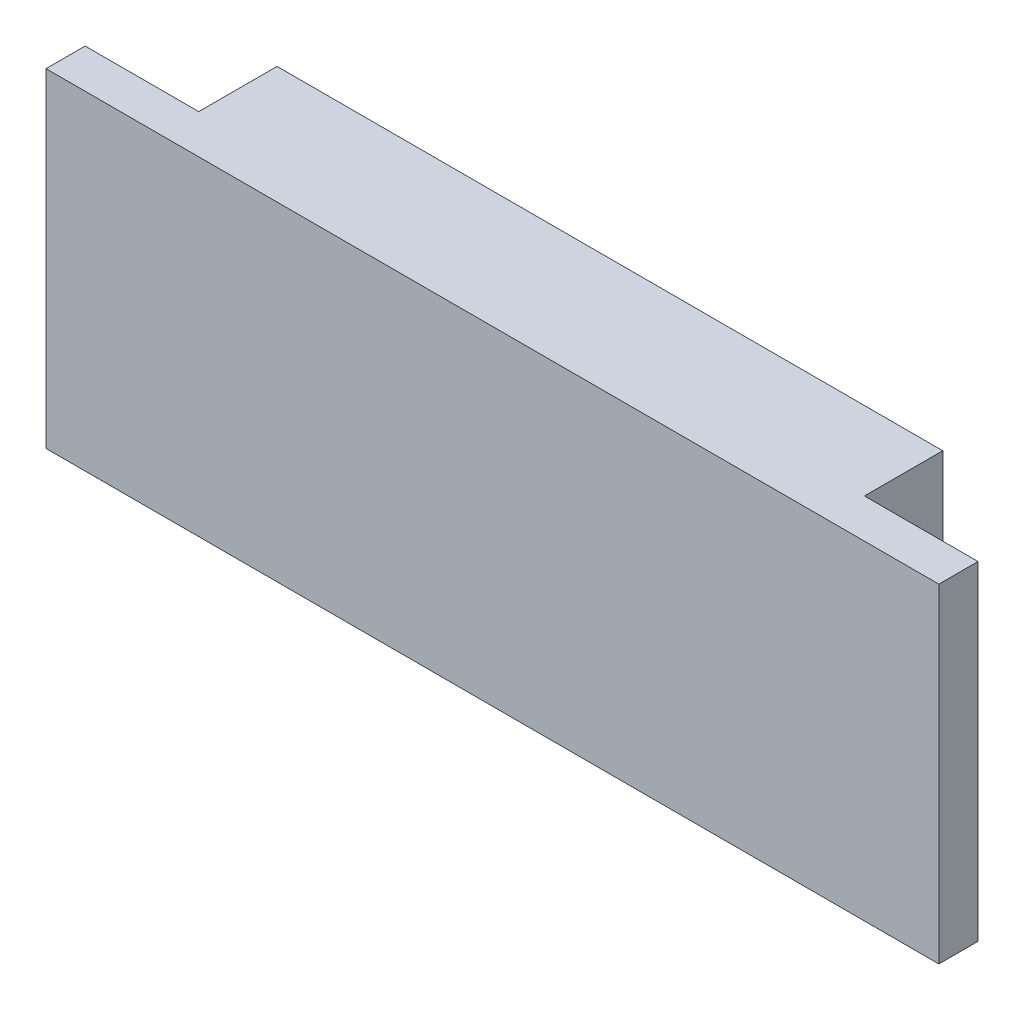
ISO-10303-21;
HEADER;
FILE_DESCRIPTION(('STEP AP214'),'2;1');
FILE_NAME('part.step','',(''),(''),'','','');
FILE_SCHEMA(('AUTOMOTIVE_DESIGN { 1 0 10303 214 1 1 1 1 }'));
ENDSEC;
DATA;
#1=APPLICATION_CONTEXT('core data for automotive mechanical design processes');
#2=APPLICATION_PROTOCOL_DEFINITION('international standard','automotive_design',2000,#1);
#3=PRODUCT_CONTEXT('',#1,'mechanical');
#4=PRODUCT('Part','Part','',(#3));
#5=PRODUCT_RELATED_PRODUCT_CATEGORY('part','',(#4));
#6=PRODUCT_DEFINITION_FORMATION('','',#4);
#7=PRODUCT_DEFINITION_CONTEXT('part definition',#1,'design');
#8=PRODUCT_DEFINITION('design','',#6,#7);
#9=PRODUCT_DEFINITION_SHAPE('','',#8);
#10=(LENGTH_UNIT() NAMED_UNIT(*) SI_UNIT(.MILLI.,.METRE.));
#11=(NAMED_UNIT(*) PLANE_ANGLE_UNIT() SI_UNIT($,.RADIAN.));
#12=(NAMED_UNIT(*) SI_UNIT($,.STERADIAN.) SOLID_ANGLE_UNIT());
#13=UNCERTAINTY_MEASURE_WITH_UNIT(LENGTH_MEASURE(1.E-05),#10,'distance_accuracy_value','');
#14=(GEOMETRIC_REPRESENTATION_CONTEXT(3) GLOBAL_UNCERTAINTY_ASSIGNED_CONTEXT((#13)) GLOBAL_UNIT_ASSIGNED_CONTEXT((#10,
#11,#12)) REPRESENTATION_CONTEXT('',''));
#15=CARTESIAN_POINT('',(0.,0.,0.));
#16=DIRECTION('',(0.,0.,1.));
#17=DIRECTION('',(1.,0.,0.));
#18=AXIS2_PLACEMENT_3D('',#15,#16,#17);
#19=CARTESIAN_POINT('',(0.,0.,0.));
#20=DIRECTION('',(0.,0.,-1.));
#21=DIRECTION('',(-1.,0.,0.));
#22=AXIS2_PLACEMENT_3D('',#19,#20,#21);
#23=PLANE('',#22);
#24=DIRECTION('',(0.,1.,0.));
#25=VECTOR('',#24,1.);
#26=CARTESIAN_POINT('',(-21.25,-10.5,0.));
#27=LINE('',#26,#25);
#28=CARTESIAN_POINT('',(-21.25,-10.5,0.));
#29=VERTEX_POINT('',#28);
#30=CARTESIAN_POINT('',(-21.25,10.5,0.));
#31=VERTEX_POINT('',#30);
#32=EDGE_CURVE('E120',#29,#31,#27,.T.);
#33=ORIENTED_EDGE('',*,*,#32,.F.);
#34=DIRECTION('',(1.,0.,0.));
#35=VECTOR('',#34,1.);
#36=CARTESIAN_POINT('',(-28.5,-10.5,0.));
#37=LINE('',#36,#35);
#38=CARTESIAN_POINT('',(-28.5,-10.5,0.));
#39=VERTEX_POINT('',#38);
#40=EDGE_CURVE('E133',#39,#29,#37,.T.);
#41=ORIENTED_EDGE('',*,*,#40,.F.);
#42=DIRECTION('',(0.,-1.,0.));
#43=VECTOR('',#42,1.);
#44=CARTESIAN_POINT('',(-28.5,-10.5,0.));
#45=LINE('',#44,#43);
#46=CARTESIAN_POINT('',(-28.5,10.5,0.));
#47=VERTEX_POINT('',#46);
#48=EDGE_CURVE('E142',#47,#39,#45,.T.);
#49=ORIENTED_EDGE('',*,*,#48,.F.);
#50=DIRECTION('',(-1.,0.,0.));
#51=VECTOR('',#50,1.);
#52=CARTESIAN_POINT('',(-28.5,10.5,0.));
#53=LINE('',#52,#51);
#54=EDGE_CURVE('E49',#31,#47,#53,.T.);
#55=ORIENTED_EDGE('',*,*,#54,.F.);
#56=EDGE_LOOP('',(#33,#41,#49,#55));
#57=FACE_BOUND('',#56,.T.);
#58=ADVANCED_FACE('F34',(#57),#23,.T.);
#59=CARTESIAN_POINT('',(28.5,-10.5,2.5));
#60=DIRECTION('',(-1.,0.,0.));
#61=DIRECTION('',(0.,0.,1.));
#62=AXIS2_PLACEMENT_3D('',#59,#60,#61);
#63=PLANE('',#62);
#64=DIRECTION('',(0.,1.,0.));
#65=VECTOR('',#64,1.);
#66=CARTESIAN_POINT('',(28.5,-10.5,0.));
#67=LINE('',#66,#65);
#68=CARTESIAN_POINT('',(28.5,-10.5,0.));
#69=VERTEX_POINT('',#68);
#70=CARTESIAN_POINT('',(28.5,10.5,0.));
#71=VERTEX_POINT('',#70);
#72=EDGE_CURVE('E121',#69,#71,#67,.T.);
#73=ORIENTED_EDGE('',*,*,#72,.T.);
#74=DIRECTION('',(0.,0.,-1.));
#75=VECTOR('',#74,1.);
#76=CARTESIAN_POINT('',(28.5,10.5,2.5));
#77=LINE('',#76,#75);
#78=CARTESIAN_POINT('',(28.5,10.5,2.5));
#79=VERTEX_POINT('',#78);
#80=EDGE_CURVE('E11',#79,#71,#77,.T.);
#81=ORIENTED_EDGE('',*,*,#80,.F.);
#82=DIRECTION('',(0.,1.,0.));
#83=VECTOR('',#82,1.);
#84=CARTESIAN_POINT('',(28.5,-10.5,2.5));
#85=LINE('',#84,#83);
#86=CARTESIAN_POINT('',(28.5,-10.5,2.5));
#87=VERTEX_POINT('',#86);
#88=EDGE_CURVE('E129',#87,#79,#85,.T.);
#89=ORIENTED_EDGE('',*,*,#88,.F.);
#90=DIRECTION('',(0.,0.,-1.));
#91=VECTOR('',#90,1.);
#92=CARTESIAN_POINT('',(28.5,-10.5,2.5));
#93=LINE('',#92,#91);
#94=EDGE_CURVE('E138',#87,#69,#93,.T.);
#95=ORIENTED_EDGE('',*,*,#94,.T.);
#96=EDGE_LOOP('',(#73,#81,#89,#95));
#97=FACE_BOUND('',#96,.T.);
#98=ADVANCED_FACE('F36',(#97),#63,.F.);
#99=CARTESIAN_POINT('',(-28.5,10.5,2.5));
#100=DIRECTION('',(0.,-1.,0.));
#101=DIRECTION('',(0.,0.,-1.));
#102=AXIS2_PLACEMENT_3D('',#99,#100,#101);
#103=PLANE('',#102);
#104=CARTESIAN_POINT('',(21.25,10.5,0.));
#105=VERTEX_POINT('',#104);
#106=EDGE_CURVE('E140',#71,#105,#53,.T.);
#107=ORIENTED_EDGE('',*,*,#106,.T.);
#108=DIRECTION('',(0.,0.,1.));
#109=VECTOR('',#108,1.);
#110=CARTESIAN_POINT('',(21.25,10.5,-5.));
#111=LINE('',#110,#109);
#112=CARTESIAN_POINT('',(21.25,10.5,-5.));
#113=VERTEX_POINT('',#112);
#114=EDGE_CURVE('E105',#113,#105,#111,.T.);
#115=ORIENTED_EDGE('',*,*,#114,.F.);
#116=DIRECTION('',(1.,0.,0.));
#117=VECTOR('',#116,1.);
#118=CARTESIAN_POINT('',(21.25,10.5,-5.));
#119=LINE('',#118,#117);
#120=CARTESIAN_POINT('',(-21.25,10.5,-5.));
#121=VERTEX_POINT('',#120);
#122=EDGE_CURVE('E98',#121,#113,#119,.T.);
#123=ORIENTED_EDGE('',*,*,#122,.F.);
#124=DIRECTION('',(0.,0.,1.));
#125=VECTOR('',#124,1.);
#126=CARTESIAN_POINT('',(-21.25,10.5,-5.));
#127=LINE('',#126,#125);
#128=EDGE_CURVE('E102',#121,#31,#127,.T.);
#129=ORIENTED_EDGE('',*,*,#128,.T.);
#130=ORIENTED_EDGE('',*,*,#54,.T.);
#131=DIRECTION('',(0.,0.,-1.));
#132=VECTOR('',#131,1.);
#133=CARTESIAN_POINT('',(-28.5,10.5,2.5));
#134=LINE('',#133,#132);
#135=CARTESIAN_POINT('',(-28.5,10.5,2.5));
#136=VERTEX_POINT('',#135);
#137=EDGE_CURVE('E42',#136,#47,#134,.T.);
#138=ORIENTED_EDGE('',*,*,#137,.F.);
#139=DIRECTION('',(-1.,0.,0.));
#140=VECTOR('',#139,1.);
#141=CARTESIAN_POINT('',(-28.5,10.5,2.5));
#142=LINE('',#141,#140);
#143=EDGE_CURVE('E132',#79,#136,#142,.T.);
#144=ORIENTED_EDGE('',*,*,#143,.F.);
#145=ORIENTED_EDGE('',*,*,#80,.T.);
#146=EDGE_LOOP('',(#107,#115,#123,#129,#130,#138,#144,#145));
#147=FACE_BOUND('',#146,.T.);
#148=ADVANCED_FACE('F100',(#147),#103,.F.);
#149=CARTESIAN_POINT('',(-28.5,-10.5,2.5));
#150=DIRECTION('',(1.,0.,0.));
#151=DIRECTION('',(0.,0.,-1.));
#152=AXIS2_PLACEMENT_3D('',#149,#150,#151);
#153=PLANE('',#152);
#154=ORIENTED_EDGE('',*,*,#48,.T.);
#155=DIRECTION('',(0.,0.,-1.));
#156=VECTOR('',#155,1.);
#157=CARTESIAN_POINT('',(-28.5,-10.5,2.5));
#158=LINE('',#157,#156);
#159=CARTESIAN_POINT('',(-28.5,-10.5,2.5));
#160=VERTEX_POINT('',#159);
#161=EDGE_CURVE('E149',#160,#39,#158,.T.);
#162=ORIENTED_EDGE('',*,*,#161,.F.);
#163=DIRECTION('',(0.,-1.,0.));
#164=VECTOR('',#163,1.);
#165=CARTESIAN_POINT('',(-28.5,-10.5,2.5));
#166=LINE('',#165,#164);
#167=EDGE_CURVE('E135',#136,#160,#166,.T.);
#168=ORIENTED_EDGE('',*,*,#167,.F.);
#169=ORIENTED_EDGE('',*,*,#137,.T.);
#170=EDGE_LOOP('',(#154,#162,#168,#169));
#171=FACE_BOUND('',#170,.T.);
#172=ADVANCED_FACE('F155',(#171),#153,.F.);
#173=CARTESIAN_POINT('',(-28.5,-10.5,2.5));
#174=DIRECTION('',(0.,1.,0.));
#175=DIRECTION('',(0.,0.,1.));
#176=AXIS2_PLACEMENT_3D('',#173,#174,#175);
#177=PLANE('',#176);
#178=ORIENTED_EDGE('',*,*,#40,.T.);
#179=DIRECTION('',(0.,0.,1.));
#180=VECTOR('',#179,1.);
#181=CARTESIAN_POINT('',(-21.25,-10.5,-5.));
#182=LINE('',#181,#180);
#183=CARTESIAN_POINT('',(-21.25,-10.5,-5.));
#184=VERTEX_POINT('',#183);
#185=EDGE_CURVE('E160',#184,#29,#182,.T.);
#186=ORIENTED_EDGE('',*,*,#185,.F.);
#187=DIRECTION('',(-1.,0.,0.));
#188=VECTOR('',#187,1.);
#189=CARTESIAN_POINT('',(21.25,-10.5,-5.));
#190=LINE('',#189,#188);
#191=CARTESIAN_POINT('',(21.25,-10.5,-5.));
#192=VERTEX_POINT('',#191);
#193=EDGE_CURVE('E114',#192,#184,#190,.T.);
#194=ORIENTED_EDGE('',*,*,#193,.F.);
#195=DIRECTION('',(0.,0.,1.));
#196=VECTOR('',#195,1.);
#197=CARTESIAN_POINT('',(21.25,-10.5,-5.));
#198=LINE('',#197,#196);
#199=CARTESIAN_POINT('',(21.25,-10.5,0.));
#200=VERTEX_POINT('',#199);
#201=EDGE_CURVE('E125',#192,#200,#198,.T.);
#202=ORIENTED_EDGE('',*,*,#201,.T.);
#203=EDGE_CURVE('E144',#200,#69,#37,.T.);
#204=ORIENTED_EDGE('',*,*,#203,.T.);
#205=ORIENTED_EDGE('',*,*,#94,.F.);
#206=DIRECTION('',(1.,0.,0.));
#207=VECTOR('',#206,1.);
#208=CARTESIAN_POINT('',(-28.5,-10.5,2.5));
#209=LINE('',#208,#207);
#210=EDGE_CURVE('E137',#160,#87,#209,.T.);
#211=ORIENTED_EDGE('',*,*,#210,.F.);
#212=ORIENTED_EDGE('',*,*,#161,.T.);
#213=EDGE_LOOP('',(#178,#186,#194,#202,#204,#205,#211,#212));
#214=FACE_BOUND('',#213,.T.);
#215=ADVANCED_FACE('F159',(#214),#177,.F.);
#216=CARTESIAN_POINT('',(0.,0.,2.5));
#217=DIRECTION('',(0.,0.,-1.));
#218=DIRECTION('',(-1.,0.,0.));
#219=AXIS2_PLACEMENT_3D('',#216,#217,#218);
#220=PLANE('',#219);
#221=ORIENTED_EDGE('',*,*,#88,.T.);
#222=ORIENTED_EDGE('',*,*,#143,.T.);
#223=ORIENTED_EDGE('',*,*,#167,.T.);
#224=ORIENTED_EDGE('',*,*,#210,.T.);
#225=EDGE_LOOP('',(#221,#222,#223,#224));
#226=FACE_BOUND('',#225,.T.);
#227=ADVANCED_FACE('F178',(#226),#220,.F.);
#228=DIRECTION('',(0.,-1.,0.));
#229=VECTOR('',#228,1.);
#230=CARTESIAN_POINT('',(21.25,-10.5,0.));
#231=LINE('',#230,#229);
#232=EDGE_CURVE('E57',#105,#200,#231,.T.);
#233=ORIENTED_EDGE('',*,*,#232,.F.);
#234=ORIENTED_EDGE('',*,*,#106,.F.);
#235=ORIENTED_EDGE('',*,*,#72,.F.);
#236=ORIENTED_EDGE('',*,*,#203,.F.);
#237=EDGE_LOOP('',(#233,#234,#235,#236));
#238=FACE_BOUND('',#237,.T.);
#239=ADVANCED_FACE('F176',(#238),#23,.T.);
#240=CARTESIAN_POINT('',(-21.25,-10.5,-5.));
#241=DIRECTION('',(1.,0.,0.));
#242=DIRECTION('',(0.,0.,-1.));
#243=AXIS2_PLACEMENT_3D('',#240,#241,#242);
#244=PLANE('',#243);
#245=ORIENTED_EDGE('',*,*,#32,.T.);
#246=ORIENTED_EDGE('',*,*,#128,.F.);
#247=DIRECTION('',(0.,1.,0.));
#248=VECTOR('',#247,1.);
#249=CARTESIAN_POINT('',(-21.25,-10.5,-5.));
#250=LINE('',#249,#248);
#251=EDGE_CURVE('E109',#184,#121,#250,.T.);
#252=ORIENTED_EDGE('',*,*,#251,.F.);
#253=ORIENTED_EDGE('',*,*,#185,.T.);
#254=EDGE_LOOP('',(#245,#246,#252,#253));
#255=FACE_BOUND('',#254,.T.);
#256=ADVANCED_FACE('F119',(#255),#244,.F.);
#257=CARTESIAN_POINT('',(21.25,-10.5,-5.));
#258=DIRECTION('',(-1.,0.,0.));
#259=DIRECTION('',(0.,0.,1.));
#260=AXIS2_PLACEMENT_3D('',#257,#258,#259);
#261=PLANE('',#260);
#262=ORIENTED_EDGE('',*,*,#232,.T.);
#263=ORIENTED_EDGE('',*,*,#201,.F.);
#264=DIRECTION('',(0.,-1.,0.));
#265=VECTOR('',#264,1.);
#266=CARTESIAN_POINT('',(21.25,-10.5,-5.));
#267=LINE('',#266,#265);
#268=EDGE_CURVE('E108',#113,#192,#267,.T.);
#269=ORIENTED_EDGE('',*,*,#268,.F.);
#270=ORIENTED_EDGE('',*,*,#114,.T.);
#271=EDGE_LOOP('',(#262,#263,#269,#270));
#272=FACE_BOUND('',#271,.T.);
#273=ADVANCED_FACE('F170',(#272),#261,.F.);
#274=CARTESIAN_POINT('',(0.,0.,-5.));
#275=DIRECTION('',(0.,0.,1.));
#276=DIRECTION('',(1.,0.,0.));
#277=AXIS2_PLACEMENT_3D('',#274,#275,#276);
#278=PLANE('',#277);
#279=ORIENTED_EDGE('',*,*,#251,.T.);
#280=ORIENTED_EDGE('',*,*,#122,.T.);
#281=ORIENTED_EDGE('',*,*,#268,.T.);
#282=ORIENTED_EDGE('',*,*,#193,.T.);
#283=EDGE_LOOP('',(#279,#280,#281,#282));
#284=FACE_BOUND('',#283,.T.);
#285=ADVANCED_FACE('F112',(#284),#278,.F.);
#286=CLOSED_SHELL('',(#58,#98,#148,#172,#215,#227,#239,#256,#273,#285));
#287=MANIFOLD_SOLID_BREP('B2',#286);
#288=ADVANCED_BREP_SHAPE_REPRESENTATION('',(#18,#287),#14);
#289=SHAPE_DEFINITION_REPRESENTATION(#9,#288);
ENDSEC;
END-ISO-10303-21;
